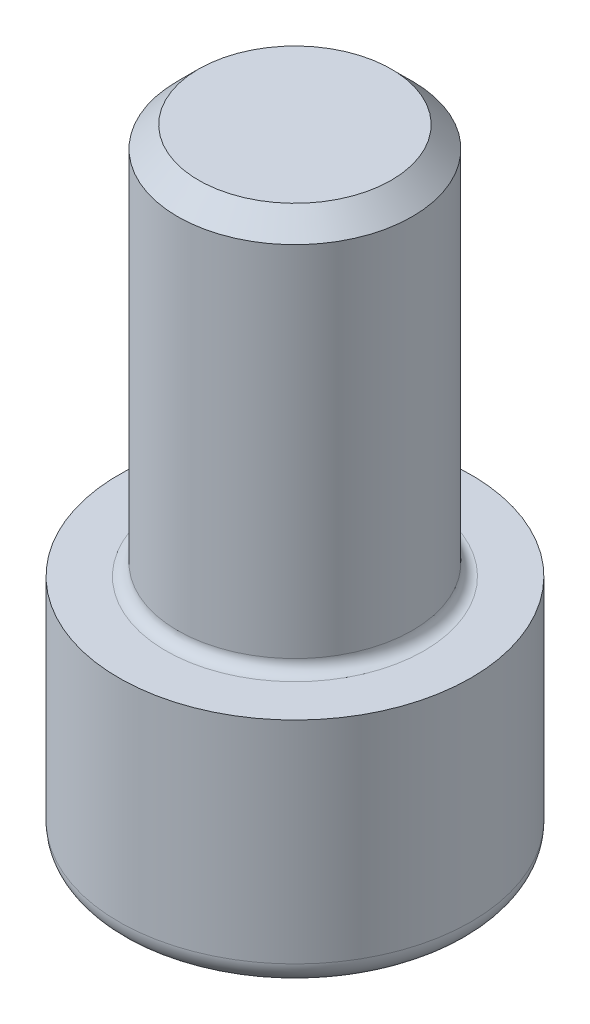
ISO-10303-21;
HEADER;
FILE_DESCRIPTION(('STEP AP214'),'2;1');
FILE_NAME('part.step','',(''),(''),'','','');
FILE_SCHEMA(('AUTOMOTIVE_DESIGN { 1 0 10303 214 1 1 1 1 }'));
ENDSEC;
DATA;
#1=APPLICATION_CONTEXT('core data for automotive mechanical design processes');
#2=APPLICATION_PROTOCOL_DEFINITION('international standard','automotive_design',2000,#1);
#3=PRODUCT_CONTEXT('',#1,'mechanical');
#4=PRODUCT('Part','Part','',(#3));
#5=PRODUCT_RELATED_PRODUCT_CATEGORY('part','',(#4));
#6=PRODUCT_DEFINITION_FORMATION('','',#4);
#7=PRODUCT_DEFINITION_CONTEXT('part definition',#1,'design');
#8=PRODUCT_DEFINITION('design','',#6,#7);
#9=PRODUCT_DEFINITION_SHAPE('','',#8);
#10=(LENGTH_UNIT() NAMED_UNIT(*) SI_UNIT(.MILLI.,.METRE.));
#11=(NAMED_UNIT(*) PLANE_ANGLE_UNIT() SI_UNIT($,.RADIAN.));
#12=(NAMED_UNIT(*) SI_UNIT($,.STERADIAN.) SOLID_ANGLE_UNIT());
#13=UNCERTAINTY_MEASURE_WITH_UNIT(LENGTH_MEASURE(1.E-05),#10,'distance_accuracy_value','');
#14=(GEOMETRIC_REPRESENTATION_CONTEXT(3) GLOBAL_UNCERTAINTY_ASSIGNED_CONTEXT((#13)) GLOBAL_UNIT_ASSIGNED_CONTEXT((#10,
#11,#12)) REPRESENTATION_CONTEXT('',''));
#15=CARTESIAN_POINT('',(0.,0.,0.));
#16=DIRECTION('',(0.,0.,1.));
#17=DIRECTION('',(1.,0.,0.));
#18=AXIS2_PLACEMENT_3D('',#15,#16,#17);
#19=CARTESIAN_POINT('',(0.,-12.,0.));
#20=DIRECTION('',(0.,-1.,0.));
#21=DIRECTION('',(1.,0.,0.));
#22=AXIS2_PLACEMENT_3D('',#19,#20,#21);
#23=PLANE('',#22);
#24=CARTESIAN_POINT('',(0.,-12.,0.));
#25=DIRECTION('',(0.,-1.,0.));
#26=DIRECTION('',(1.,0.,0.));
#27=AXIS2_PLACEMENT_3D('',#24,#25,#26);
#28=CIRCLE('',#27,7.8);
#29=CARTESIAN_POINT('',(7.8,-12.,0.));
#30=VERTEX_POINT('',#29);
#31=EDGE_CURVE('E25',#30,#30,#28,.T.);
#32=ORIENTED_EDGE('',*,*,#31,.T.);
#33=EDGE_LOOP('',(#32));
#34=FACE_BOUND('',#33,.T.);
#35=DIRECTION('',(-1.,0.,0.));
#36=VECTOR('',#35,1.);
#37=CARTESIAN_POINT('',(0.721687836475,-12.,-5.));
#38=LINE('',#37,#36);
#39=CARTESIAN_POINT('',(2.8867513459,-12.,-5.));
#40=VERTEX_POINT('',#39);
#41=CARTESIAN_POINT('',(-2.8867513459,-12.,-5.));
#42=VERTEX_POINT('',#41);
#43=EDGE_CURVE('E109',#40,#42,#38,.T.);
#44=ORIENTED_EDGE('',*,*,#43,.T.);
#45=DIRECTION('',(-0.500000000006738,0.,0.866025403780548));
#46=VECTOR('',#45,1.);
#47=CARTESIAN_POINT('',(-4.33012701889305,-12.,-2.50000000001204));
#48=LINE('',#47,#46);
#49=CARTESIAN_POINT('',(-5.7735026919,-12.,0.));
#50=VERTEX_POINT('',#49);
#51=EDGE_CURVE('E118',#42,#50,#48,.T.);
#52=ORIENTED_EDGE('',*,*,#51,.T.);
#53=DIRECTION('',(0.500000000006738,0.,0.866025403780548));
#54=VECTOR('',#53,1.);
#55=CARTESIAN_POINT('',(-4.33012701889305,-12.,2.50000000001204));
#56=LINE('',#55,#54);
#57=CARTESIAN_POINT('',(-2.8867513459,-12.,5.));
#58=VERTEX_POINT('',#57);
#59=EDGE_CURVE('E114',#50,#58,#56,.T.);
#60=ORIENTED_EDGE('',*,*,#59,.T.);
#61=DIRECTION('',(1.,0.,0.));
#62=VECTOR('',#61,1.);
#63=CARTESIAN_POINT('',(0.,-12.,5.));
#64=LINE('',#63,#62);
#65=CARTESIAN_POINT('',(2.8867513459,-12.,5.));
#66=VERTEX_POINT('',#65);
#67=EDGE_CURVE('E126',#58,#66,#64,.T.);
#68=ORIENTED_EDGE('',*,*,#67,.T.);
#69=DIRECTION('',(0.500000000006738,0.,-0.866025403780548));
#70=VECTOR('',#69,1.);
#71=CARTESIAN_POINT('',(4.33012701889305,-12.,2.50000000001204));
#72=LINE('',#71,#70);
#73=CARTESIAN_POINT('',(5.7735026919,-12.,0.));
#74=VERTEX_POINT('',#73);
#75=EDGE_CURVE('E19',#66,#74,#72,.T.);
#76=ORIENTED_EDGE('',*,*,#75,.T.);
#77=DIRECTION('',(-0.500000000006738,0.,-0.866025403780548));
#78=VECTOR('',#77,1.);
#79=CARTESIAN_POINT('',(4.33012701889305,-12.,-2.50000000001204));
#80=LINE('',#79,#78);
#81=EDGE_CURVE('E108',#74,#40,#80,.T.);
#82=ORIENTED_EDGE('',*,*,#81,.T.);
#83=EDGE_LOOP('',(#44,#52,#60,#68,#76,#82));
#84=FACE_BOUND('',#83,.T.);
#85=ADVANCED_FACE('F16',(#34,#84),#23,.T.);
#86=CARTESIAN_POINT('',(0.,0.,0.));
#87=DIRECTION('',(0.,1.,0.));
#88=DIRECTION('',(-1.,0.,0.));
#89=AXIS2_PLACEMENT_3D('',#86,#87,#88);
#90=PLANE('',#89);
#91=CARTESIAN_POINT('',(0.,0.,0.));
#92=DIRECTION('',(0.,1.,0.));
#93=DIRECTION('',(1.,0.,0.));
#94=AXIS2_PLACEMENT_3D('',#91,#92,#93);
#95=CIRCLE('',#94,9.);
#96=CARTESIAN_POINT('',(9.,0.,0.));
#97=VERTEX_POINT('',#96);
#98=EDGE_CURVE('E11',#97,#97,#95,.T.);
#99=ORIENTED_EDGE('',*,*,#98,.T.);
#100=EDGE_LOOP('',(#99));
#101=FACE_BOUND('',#100,.T.);
#102=CARTESIAN_POINT('',(0.,0.,0.));
#103=DIRECTION('',(0.,-1.,0.));
#104=DIRECTION('',(1.,0.,0.));
#105=AXIS2_PLACEMENT_3D('',#102,#103,#104);
#106=CIRCLE('',#105,6.6);
#107=CARTESIAN_POINT('',(6.6,0.,0.));
#108=VERTEX_POINT('',#107);
#109=EDGE_CURVE('E95',#108,#108,#106,.T.);
#110=ORIENTED_EDGE('',*,*,#109,.T.);
#111=EDGE_LOOP('',(#110));
#112=FACE_BOUND('',#111,.T.);
#113=ADVANCED_FACE('F96',(#101,#112),#90,.T.);
#114=CARTESIAN_POINT('',(0.,-6.,0.));
#115=DIRECTION('',(0.,1.,0.));
#116=DIRECTION('',(1.,0.,0.));
#117=AXIS2_PLACEMENT_3D('',#114,#115,#116);
#118=CYLINDRICAL_SURFACE('',#117,9.);
#119=ORIENTED_EDGE('',*,*,#98,.F.);
#120=EDGE_LOOP('',(#119));
#121=FACE_BOUND('',#120,.T.);
#122=CARTESIAN_POINT('',(0.,-10.8,0.));
#123=DIRECTION('',(0.,1.,0.));
#124=DIRECTION('',(1.,0.,0.));
#125=AXIS2_PLACEMENT_3D('',#122,#123,#124);
#126=CIRCLE('',#125,9.);
#127=CARTESIAN_POINT('',(9.,-10.8,0.));
#128=VERTEX_POINT('',#127);
#129=EDGE_CURVE('E120',#128,#128,#126,.T.);
#130=ORIENTED_EDGE('',*,*,#129,.T.);
#131=EDGE_LOOP('',(#130));
#132=FACE_BOUND('',#131,.T.);
#133=ADVANCED_FACE('F151',(#121,#132),#118,.T.);
#134=CARTESIAN_POINT('',(0.,-10.8,0.));
#135=DIRECTION('',(0.,-1.,0.));
#136=DIRECTION('',(0.,0.,-1.));
#137=AXIS2_PLACEMENT_3D('',#134,#135,#136);
#138=TOROIDAL_SURFACE('',#137,7.8,1.2);
#139=ORIENTED_EDGE('',*,*,#31,.F.);
#140=EDGE_LOOP('',(#139));
#141=FACE_BOUND('',#140,.T.);
#142=ORIENTED_EDGE('',*,*,#129,.F.);
#143=EDGE_LOOP('',(#142));
#144=FACE_BOUND('',#143,.T.);
#145=ADVANCED_FACE('F153',(#141,#144),#138,.T.);
#146=CARTESIAN_POINT('',(0.,-6.,0.));
#147=DIRECTION('',(0.,1.,0.));
#148=DIRECTION('',(0.,0.,-1.));
#149=AXIS2_PLACEMENT_3D('',#146,#147,#148);
#150=PLANE('',#149);
#151=DIRECTION('',(1.,0.,0.));
#152=VECTOR('',#151,1.);
#153=CARTESIAN_POINT('',(0.,-6.,-5.));
#154=LINE('',#153,#152);
#155=CARTESIAN_POINT('',(-2.8867513459,-6.,-5.));
#156=VERTEX_POINT('',#155);
#157=CARTESIAN_POINT('',(2.8867513459,-6.,-5.));
#158=VERTEX_POINT('',#157);
#159=EDGE_CURVE('E98',#156,#158,#154,.T.);
#160=ORIENTED_EDGE('',*,*,#159,.T.);
#161=DIRECTION('',(0.500000000006738,0.,0.866025403780548));
#162=VECTOR('',#161,1.);
#163=CARTESIAN_POINT('',(5.7735026919,-6.,0.));
#164=LINE('',#163,#162);
#165=CARTESIAN_POINT('',(5.7735026919,-6.,0.));
#166=VERTEX_POINT('',#165);
#167=EDGE_CURVE('E123',#158,#166,#164,.T.);
#168=ORIENTED_EDGE('',*,*,#167,.T.);
#169=DIRECTION('',(-0.500000000006738,0.,0.866025403780548));
#170=VECTOR('',#169,1.);
#171=CARTESIAN_POINT('',(2.8867513459,-6.,5.));
#172=LINE('',#171,#170);
#173=CARTESIAN_POINT('',(2.8867513459,-6.,5.));
#174=VERTEX_POINT('',#173);
#175=EDGE_CURVE('E64',#166,#174,#172,.T.);
#176=ORIENTED_EDGE('',*,*,#175,.T.);
#177=DIRECTION('',(-1.,0.,0.));
#178=VECTOR('',#177,1.);
#179=CARTESIAN_POINT('',(-2.8867513459,-6.,5.));
#180=LINE('',#179,#178);
#181=CARTESIAN_POINT('',(-2.8867513459,-6.,5.));
#182=VERTEX_POINT('',#181);
#183=EDGE_CURVE('E128',#174,#182,#180,.T.);
#184=ORIENTED_EDGE('',*,*,#183,.T.);
#185=DIRECTION('',(-0.500000000006738,0.,-0.866025403780548));
#186=VECTOR('',#185,1.);
#187=CARTESIAN_POINT('',(-5.7735026919,-6.,0.));
#188=LINE('',#187,#186);
#189=CARTESIAN_POINT('',(-5.7735026919,-6.,0.));
#190=VERTEX_POINT('',#189);
#191=EDGE_CURVE('E117',#182,#190,#188,.T.);
#192=ORIENTED_EDGE('',*,*,#191,.T.);
#193=DIRECTION('',(0.500000000006738,0.,-0.866025403780548));
#194=VECTOR('',#193,1.);
#195=CARTESIAN_POINT('',(-2.8867513459,-6.,-5.));
#196=LINE('',#195,#194);
#197=EDGE_CURVE('E90',#190,#156,#196,.T.);
#198=ORIENTED_EDGE('',*,*,#197,.T.);
#199=EDGE_LOOP('',(#160,#168,#176,#184,#192,#198));
#200=FACE_BOUND('',#199,.T.);
#201=ADVANCED_FACE('F155',(#200),#150,.F.);
#202=CARTESIAN_POINT('',(-4.3301270189,-12.,-2.5));
#203=DIRECTION('',(-0.866025403780548,0.,-0.500000000006738));
#204=DIRECTION('',(-0.500000000006738,0.,0.866025403780548));
#205=AXIS2_PLACEMENT_3D('',#202,#203,#204);
#206=PLANE('',#205);
#207=ORIENTED_EDGE('',*,*,#197,.F.);
#208=DIRECTION('',(0.,1.,0.));
#209=VECTOR('',#208,1.);
#210=CARTESIAN_POINT('',(-5.7735026919,-12.,0.));
#211=LINE('',#210,#209);
#212=EDGE_CURVE('E116',#50,#190,#211,.T.);
#213=ORIENTED_EDGE('',*,*,#212,.F.);
#214=ORIENTED_EDGE('',*,*,#51,.F.);
#215=DIRECTION('',(0.,1.,0.));
#216=VECTOR('',#215,1.);
#217=CARTESIAN_POINT('',(-2.8867513459,-12.,-5.));
#218=LINE('',#217,#216);
#219=EDGE_CURVE('E101',#42,#156,#218,.T.);
#220=ORIENTED_EDGE('',*,*,#219,.T.);
#221=EDGE_LOOP('',(#207,#213,#214,#220));
#222=FACE_BOUND('',#221,.T.);
#223=ADVANCED_FACE('F163',(#222),#206,.F.);
#224=CARTESIAN_POINT('',(-4.3301270189,-12.,2.5));
#225=DIRECTION('',(-0.866025403780548,0.,0.500000000006738));
#226=DIRECTION('',(0.500000000006738,0.,0.866025403780548));
#227=AXIS2_PLACEMENT_3D('',#224,#225,#226);
#228=PLANE('',#227);
#229=ORIENTED_EDGE('',*,*,#191,.F.);
#230=DIRECTION('',(0.,1.,0.));
#231=VECTOR('',#230,1.);
#232=CARTESIAN_POINT('',(-2.8867513459,-12.,5.));
#233=LINE('',#232,#231);
#234=EDGE_CURVE('E127',#58,#182,#233,.T.);
#235=ORIENTED_EDGE('',*,*,#234,.F.);
#236=ORIENTED_EDGE('',*,*,#59,.F.);
#237=ORIENTED_EDGE('',*,*,#212,.T.);
#238=EDGE_LOOP('',(#229,#235,#236,#237));
#239=FACE_BOUND('',#238,.T.);
#240=ADVANCED_FACE('F185',(#239),#228,.F.);
#241=CARTESIAN_POINT('',(0.,-12.,5.));
#242=DIRECTION('',(0.,0.,1.));
#243=DIRECTION('',(1.,0.,0.));
#244=AXIS2_PLACEMENT_3D('',#241,#242,#243);
#245=PLANE('',#244);
#246=ORIENTED_EDGE('',*,*,#183,.F.);
#247=DIRECTION('',(0.,1.,0.));
#248=VECTOR('',#247,1.);
#249=CARTESIAN_POINT('',(2.8867513459,-12.,5.));
#250=LINE('',#249,#248);
#251=EDGE_CURVE('E137',#66,#174,#250,.T.);
#252=ORIENTED_EDGE('',*,*,#251,.F.);
#253=ORIENTED_EDGE('',*,*,#67,.F.);
#254=ORIENTED_EDGE('',*,*,#234,.T.);
#255=EDGE_LOOP('',(#246,#252,#253,#254));
#256=FACE_BOUND('',#255,.T.);
#257=ADVANCED_FACE('F187',(#256),#245,.F.);
#258=CARTESIAN_POINT('',(4.3301270189,-12.,2.5));
#259=DIRECTION('',(0.866025403780548,0.,0.500000000006738));
#260=DIRECTION('',(0.500000000006738,0.,-0.866025403780548));
#261=AXIS2_PLACEMENT_3D('',#258,#259,#260);
#262=PLANE('',#261);
#263=ORIENTED_EDGE('',*,*,#175,.F.);
#264=DIRECTION('',(0.,1.,0.));
#265=VECTOR('',#264,1.);
#266=CARTESIAN_POINT('',(5.7735026919,-12.,0.));
#267=LINE('',#266,#265);
#268=EDGE_CURVE('E106',#74,#166,#267,.T.);
#269=ORIENTED_EDGE('',*,*,#268,.F.);
#270=ORIENTED_EDGE('',*,*,#75,.F.);
#271=ORIENTED_EDGE('',*,*,#251,.T.);
#272=EDGE_LOOP('',(#263,#269,#270,#271));
#273=FACE_BOUND('',#272,.T.);
#274=ADVANCED_FACE('F188',(#273),#262,.F.);
#275=CARTESIAN_POINT('',(4.3301270189,-12.,-2.5));
#276=DIRECTION('',(0.866025403780548,0.,-0.500000000006738));
#277=DIRECTION('',(-0.500000000006738,0.,-0.866025403780548));
#278=AXIS2_PLACEMENT_3D('',#275,#276,#277);
#279=PLANE('',#278);
#280=ORIENTED_EDGE('',*,*,#167,.F.);
#281=DIRECTION('',(0.,1.,0.));
#282=VECTOR('',#281,1.);
#283=CARTESIAN_POINT('',(2.8867513459,-12.,-5.));
#284=LINE('',#283,#282);
#285=EDGE_CURVE('E112',#40,#158,#284,.T.);
#286=ORIENTED_EDGE('',*,*,#285,.F.);
#287=ORIENTED_EDGE('',*,*,#81,.F.);
#288=ORIENTED_EDGE('',*,*,#268,.T.);
#289=EDGE_LOOP('',(#280,#286,#287,#288));
#290=FACE_BOUND('',#289,.T.);
#291=ADVANCED_FACE('F190',(#290),#279,.F.);
#292=CARTESIAN_POINT('',(1.44337567295,-12.,-5.));
#293=DIRECTION('',(0.,0.,-1.));
#294=DIRECTION('',(-1.,0.,0.));
#295=AXIS2_PLACEMENT_3D('',#292,#293,#294);
#296=PLANE('',#295);
#297=ORIENTED_EDGE('',*,*,#159,.F.);
#298=ORIENTED_EDGE('',*,*,#219,.F.);
#299=ORIENTED_EDGE('',*,*,#43,.F.);
#300=ORIENTED_EDGE('',*,*,#285,.T.);
#301=EDGE_LOOP('',(#297,#298,#299,#300));
#302=FACE_BOUND('',#301,.T.);
#303=ADVANCED_FACE('F181',(#302),#296,.F.);
#304=CARTESIAN_POINT('',(0.,0.6,0.));
#305=DIRECTION('',(0.,1.,0.));
#306=DIRECTION('',(1.,0.,0.));
#307=AXIS2_PLACEMENT_3D('',#304,#305,#306);
#308=TOROIDAL_SURFACE('',#307,6.6,0.6);
#309=ORIENTED_EDGE('',*,*,#109,.F.);
#310=EDGE_LOOP('',(#309));
#311=FACE_BOUND('',#310,.T.);
#312=CARTESIAN_POINT('',(0.,0.6,0.));
#313=DIRECTION('',(0.,1.,0.));
#314=DIRECTION('',(0.,0.,1.));
#315=AXIS2_PLACEMENT_3D('',#312,#313,#314);
#316=CIRCLE('',#315,6.);
#317=CARTESIAN_POINT('',(0.,0.6,-6.));
#318=VERTEX_POINT('',#317);
#319=EDGE_CURVE('E99',#318,#318,#316,.T.);
#320=ORIENTED_EDGE('',*,*,#319,.F.);
#321=EDGE_LOOP('',(#320));
#322=FACE_BOUND('',#321,.T.);
#323=ADVANCED_FACE('F197',(#311,#322),#308,.F.);
#324=CARTESIAN_POINT('',(0.,20.,0.));
#325=DIRECTION('',(0.,1.,0.));
#326=DIRECTION('',(1.,0.,0.));
#327=AXIS2_PLACEMENT_3D('',#324,#325,#326);
#328=PLANE('',#327);
#329=CARTESIAN_POINT('',(0.,20.,0.));
#330=DIRECTION('',(0.,1.,0.));
#331=DIRECTION('',(1.,0.,0.));
#332=AXIS2_PLACEMENT_3D('',#329,#330,#331);
#333=CIRCLE('',#332,4.9265);
#334=CARTESIAN_POINT('',(4.9265,20.,0.));
#335=VERTEX_POINT('',#334);
#336=EDGE_CURVE('E140',#335,#335,#333,.T.);
#337=ORIENTED_EDGE('',*,*,#336,.T.);
#338=EDGE_LOOP('',(#337));
#339=FACE_BOUND('',#338,.T.);
#340=ADVANCED_FACE('F202',(#339),#328,.T.);
#341=CARTESIAN_POINT('',(0.,10.,0.));
#342=DIRECTION('',(0.,-1.,0.));
#343=DIRECTION('',(1.,0.,0.));
#344=AXIS2_PLACEMENT_3D('',#341,#342,#343);
#345=CYLINDRICAL_SURFACE('',#344,6.);
#346=ORIENTED_EDGE('',*,*,#319,.T.);
#347=EDGE_LOOP('',(#346));
#348=FACE_BOUND('',#347,.T.);
#349=CARTESIAN_POINT('',(0.,18.9265,0.));
#350=DIRECTION('',(0.,-1.,0.));
#351=DIRECTION('',(1.,0.,0.));
#352=AXIS2_PLACEMENT_3D('',#349,#350,#351);
#353=CIRCLE('',#352,6.);
#354=CARTESIAN_POINT('',(6.,18.9265,0.));
#355=VERTEX_POINT('',#354);
#356=EDGE_CURVE('E103',#355,#355,#353,.T.);
#357=ORIENTED_EDGE('',*,*,#356,.T.);
#358=EDGE_LOOP('',(#357));
#359=FACE_BOUND('',#358,.T.);
#360=ADVANCED_FACE('F203',(#348,#359),#345,.T.);
#361=CARTESIAN_POINT('',(0.,19.46325,0.));
#362=DIRECTION('',(0.,-1.,0.));
#363=DIRECTION('',(1.,0.,0.));
#364=AXIS2_PLACEMENT_3D('',#361,#362,#363);
#365=CONICAL_SURFACE('',#364,5.46325,0.785398163397448);
#366=ORIENTED_EDGE('',*,*,#356,.F.);
#367=EDGE_LOOP('',(#366));
#368=FACE_BOUND('',#367,.T.);
#369=ORIENTED_EDGE('',*,*,#336,.F.);
#370=EDGE_LOOP('',(#369));
#371=FACE_BOUND('',#370,.T.);
#372=ADVANCED_FACE('F205',(#368,#371),#365,.T.);
#373=CLOSED_SHELL('',(#85,#113,#133,#145,#201,#223,#240,#257,#274,#291,#303,#323,#340,#360,#372));
#374=MANIFOLD_SOLID_BREP('B1',#373);
#375=ADVANCED_BREP_SHAPE_REPRESENTATION('',(#18,#374),#14);
#376=SHAPE_DEFINITION_REPRESENTATION(#9,#375);
ENDSEC;
END-ISO-10303-21;
